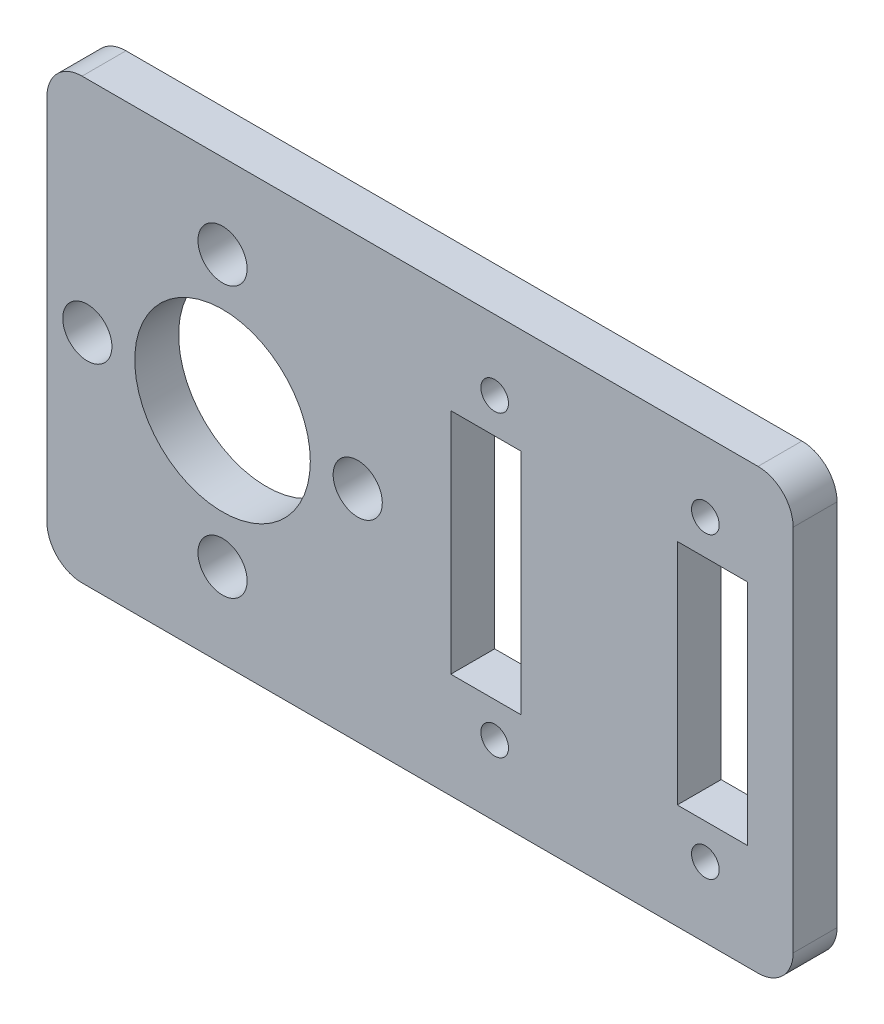
ISO-10303-21;
HEADER;
FILE_DESCRIPTION(('STEP AP214'),'2;1');
FILE_NAME('part.step','',(''),(''),'','','');
FILE_SCHEMA(('AUTOMOTIVE_DESIGN { 1 0 10303 214 1 1 1 1 }'));
ENDSEC;
DATA;
#1=APPLICATION_CONTEXT('core data for automotive mechanical design processes');
#2=APPLICATION_PROTOCOL_DEFINITION('international standard','automotive_design',2000,#1);
#3=PRODUCT_CONTEXT('',#1,'mechanical');
#4=PRODUCT('Part','Part','',(#3));
#5=PRODUCT_RELATED_PRODUCT_CATEGORY('part','',(#4));
#6=PRODUCT_DEFINITION_FORMATION('','',#4);
#7=PRODUCT_DEFINITION_CONTEXT('part definition',#1,'design');
#8=PRODUCT_DEFINITION('design','',#6,#7);
#9=PRODUCT_DEFINITION_SHAPE('','',#8);
#10=(LENGTH_UNIT() NAMED_UNIT(*) SI_UNIT(.MILLI.,.METRE.));
#11=(NAMED_UNIT(*) PLANE_ANGLE_UNIT() SI_UNIT($,.RADIAN.));
#12=(NAMED_UNIT(*) SI_UNIT($,.STERADIAN.) SOLID_ANGLE_UNIT());
#13=UNCERTAINTY_MEASURE_WITH_UNIT(LENGTH_MEASURE(1.E-05),#10,'distance_accuracy_value','');
#14=(GEOMETRIC_REPRESENTATION_CONTEXT(3) GLOBAL_UNCERTAINTY_ASSIGNED_CONTEXT((#13)) GLOBAL_UNIT_ASSIGNED_CONTEXT((#10,
#11,#12)) REPRESENTATION_CONTEXT('',''));
#15=CARTESIAN_POINT('',(0.,0.,0.));
#16=DIRECTION('',(0.,0.,1.));
#17=DIRECTION('',(1.,0.,0.));
#18=AXIS2_PLACEMENT_3D('',#15,#16,#17);
#19=CARTESIAN_POINT('',(0.,0.,3.175));
#20=DIRECTION('',(0.,0.,-1.));
#21=DIRECTION('',(-1.,0.,0.));
#22=AXIS2_PLACEMENT_3D('',#19,#20,#21);
#23=PLANE('',#22);
#24=CARTESIAN_POINT('',(2.921,15.875,3.175));
#25=DIRECTION('',(0.,0.,1.));
#26=DIRECTION('',(0.,1.,0.));
#27=AXIS2_PLACEMENT_3D('',#24,#25,#26);
#28=CIRCLE('',#27,1.778);
#29=CARTESIAN_POINT('',(2.92099999999999,17.653,3.175));
#30=VERTEX_POINT('',#29);
#31=EDGE_CURVE('E638',#30,#30,#28,.T.);
#32=ORIENTED_EDGE('',*,*,#31,.F.);
#33=EDGE_LOOP('',(#32));
#34=FACE_BOUND('',#33,.T.);
#35=CARTESIAN_POINT('',(12.7,6.096,3.175));
#36=DIRECTION('',(0.,0.,1.));
#37=DIRECTION('',(-1.,0.,0.));
#38=AXIS2_PLACEMENT_3D('',#35,#36,#37);
#39=CIRCLE('',#38,1.778);
#40=CARTESIAN_POINT('',(10.922,6.096,3.175));
#41=VERTEX_POINT('',#40);
#42=EDGE_CURVE('E632',#41,#41,#39,.T.);
#43=ORIENTED_EDGE('',*,*,#42,.F.);
#44=EDGE_LOOP('',(#43));
#45=FACE_BOUND('',#44,.T.);
#46=CARTESIAN_POINT('',(22.479,15.8750000000001,3.175));
#47=DIRECTION('',(0.,0.,1.));
#48=DIRECTION('',(0.,-1.,0.));
#49=AXIS2_PLACEMENT_3D('',#46,#47,#48);
#50=CIRCLE('',#49,1.778);
#51=CARTESIAN_POINT('',(22.479,14.0970000000001,3.175));
#52=VERTEX_POINT('',#51);
#53=EDGE_CURVE('E626',#52,#52,#50,.T.);
#54=ORIENTED_EDGE('',*,*,#53,.F.);
#55=EDGE_LOOP('',(#54));
#56=FACE_BOUND('',#55,.T.);
#57=CARTESIAN_POINT('',(12.7,25.654,3.175));
#58=DIRECTION('',(0.,0.,1.));
#59=DIRECTION('',(1.,0.,0.));
#60=AXIS2_PLACEMENT_3D('',#57,#58,#59);
#61=CIRCLE('',#60,1.778);
#62=CARTESIAN_POINT('',(14.478,25.654,3.175));
#63=VERTEX_POINT('',#62);
#64=EDGE_CURVE('E620',#63,#63,#61,.T.);
#65=ORIENTED_EDGE('',*,*,#64,.F.);
#66=EDGE_LOOP('',(#65));
#67=FACE_BOUND('',#66,.T.);
#68=CARTESIAN_POINT('',(12.7,15.875,3.175));
#69=DIRECTION('',(0.,0.,1.));
#70=DIRECTION('',(1.,0.,0.));
#71=AXIS2_PLACEMENT_3D('',#68,#69,#70);
#72=CIRCLE('',#71,6.35);
#73=CARTESIAN_POINT('',(19.05,15.875,3.175));
#74=VERTEX_POINT('',#73);
#75=EDGE_CURVE('E615',#74,#74,#72,.T.);
#76=ORIENTED_EDGE('',*,*,#75,.F.);
#77=EDGE_LOOP('',(#76));
#78=FACE_BOUND('',#77,.T.);
#79=DIRECTION('',(0.,-1.,0.));
#80=VECTOR('',#79,1.);
#81=CARTESIAN_POINT('',(29.21,24.13,3.175));
#82=LINE('',#81,#80);
#83=CARTESIAN_POINT('',(29.21,24.13,3.175));
#84=VERTEX_POINT('',#83);
#85=CARTESIAN_POINT('',(29.21,7.62,3.175));
#86=VERTEX_POINT('',#85);
#87=EDGE_CURVE('E191',#84,#86,#82,.T.);
#88=ORIENTED_EDGE('',*,*,#87,.F.);
#89=DIRECTION('',(-1.,0.,0.));
#90=VECTOR('',#89,1.);
#91=CARTESIAN_POINT('',(29.21,24.13,3.175));
#92=LINE('',#91,#90);
#93=CARTESIAN_POINT('',(34.29,24.13,3.175));
#94=VERTEX_POINT('',#93);
#95=EDGE_CURVE('E199',#94,#84,#92,.T.);
#96=ORIENTED_EDGE('',*,*,#95,.F.);
#97=DIRECTION('',(0.,1.,0.));
#98=VECTOR('',#97,1.);
#99=CARTESIAN_POINT('',(34.29,24.13,3.175));
#100=LINE('',#99,#98);
#101=CARTESIAN_POINT('',(34.29,7.62,3.175));
#102=VERTEX_POINT('',#101);
#103=EDGE_CURVE('E196',#102,#94,#100,.T.);
#104=ORIENTED_EDGE('',*,*,#103,.F.);
#105=DIRECTION('',(1.,0.,0.));
#106=VECTOR('',#105,1.);
#107=CARTESIAN_POINT('',(29.21,7.62,3.175));
#108=LINE('',#107,#106);
#109=EDGE_CURVE('E193',#86,#102,#108,.T.);
#110=ORIENTED_EDGE('',*,*,#109,.F.);
#111=EDGE_LOOP('',(#88,#96,#104,#110));
#112=FACE_BOUND('',#111,.T.);
#113=DIRECTION('',(-1.,0.,0.));
#114=VECTOR('',#113,1.);
#115=CARTESIAN_POINT('',(0.,31.75,3.175));
#116=LINE('',#115,#114);
#117=CARTESIAN_POINT('',(51.435,31.75,3.175));
#118=VERTEX_POINT('',#117);
#119=CARTESIAN_POINT('',(2.54,31.75,3.175));
#120=VERTEX_POINT('',#119);
#121=EDGE_CURVE('E254',#118,#120,#116,.T.);
#122=ORIENTED_EDGE('',*,*,#121,.T.);
#123=CARTESIAN_POINT('',(2.54,29.21,3.175));
#124=DIRECTION('',(0.,0.,-1.));
#125=DIRECTION('',(-1.,0.,0.));
#126=AXIS2_PLACEMENT_3D('',#123,#124,#125);
#127=CIRCLE('',#126,2.54);
#128=CARTESIAN_POINT('',(0.,29.21,3.175));
#129=VERTEX_POINT('',#128);
#130=EDGE_CURVE('E289',#120,#129,#127,.F.);
#131=ORIENTED_EDGE('',*,*,#130,.T.);
#132=DIRECTION('',(0.,-1.,0.));
#133=VECTOR('',#132,1.);
#134=CARTESIAN_POINT('',(0.,0.,3.175));
#135=LINE('',#134,#133);
#136=CARTESIAN_POINT('',(0.,2.54,3.175));
#137=VERTEX_POINT('',#136);
#138=EDGE_CURVE('E246',#129,#137,#135,.T.);
#139=ORIENTED_EDGE('',*,*,#138,.T.);
#140=CARTESIAN_POINT('',(2.54,2.54,3.175));
#141=DIRECTION('',(0.,0.,-1.));
#142=DIRECTION('',(-1.,0.,0.));
#143=AXIS2_PLACEMENT_3D('',#140,#141,#142);
#144=CIRCLE('',#143,2.54);
#145=CARTESIAN_POINT('',(2.54,0.,3.175));
#146=VERTEX_POINT('',#145);
#147=EDGE_CURVE('E284',#137,#146,#144,.F.);
#148=ORIENTED_EDGE('',*,*,#147,.T.);
#149=DIRECTION('',(1.,0.,0.));
#150=VECTOR('',#149,1.);
#151=CARTESIAN_POINT('',(0.,0.,3.175));
#152=LINE('',#151,#150);
#153=CARTESIAN_POINT('',(51.435,0.,3.175));
#154=VERTEX_POINT('',#153);
#155=EDGE_CURVE('E249',#146,#154,#152,.T.);
#156=ORIENTED_EDGE('',*,*,#155,.T.);
#157=CARTESIAN_POINT('',(51.435,2.54,3.175));
#158=DIRECTION('',(0.,0.,-1.));
#159=DIRECTION('',(-1.,0.,0.));
#160=AXIS2_PLACEMENT_3D('',#157,#158,#159);
#161=CIRCLE('',#160,2.54);
#162=CARTESIAN_POINT('',(53.975,2.54,3.175));
#163=VERTEX_POINT('',#162);
#164=EDGE_CURVE('E55',#154,#163,#161,.F.);
#165=ORIENTED_EDGE('',*,*,#164,.T.);
#166=DIRECTION('',(0.,1.,0.));
#167=VECTOR('',#166,1.);
#168=CARTESIAN_POINT('',(53.975,0.,3.175));
#169=LINE('',#168,#167);
#170=CARTESIAN_POINT('',(53.975,29.21,3.175));
#171=VERTEX_POINT('',#170);
#172=EDGE_CURVE('E252',#163,#171,#169,.T.);
#173=ORIENTED_EDGE('',*,*,#172,.T.);
#174=CARTESIAN_POINT('',(51.435,29.21,3.175));
#175=DIRECTION('',(0.,0.,-1.));
#176=DIRECTION('',(-1.,0.,0.));
#177=AXIS2_PLACEMENT_3D('',#174,#175,#176);
#178=CIRCLE('',#177,2.54);
#179=EDGE_CURVE('E287',#171,#118,#178,.F.);
#180=ORIENTED_EDGE('',*,*,#179,.T.);
#181=EDGE_LOOP('',(#122,#131,#139,#148,#156,#165,#173,#180));
#182=FACE_BOUND('',#181,.T.);
#183=CARTESIAN_POINT('',(32.385,26.67,3.175));
#184=DIRECTION('',(0.,0.,1.));
#185=DIRECTION('',(1.,0.,0.));
#186=AXIS2_PLACEMENT_3D('',#183,#184,#185);
#187=CIRCLE('',#186,0.999999999999998);
#188=CARTESIAN_POINT('',(33.385,26.67,3.175));
#189=VERTEX_POINT('',#188);
#190=EDGE_CURVE('E240',#189,#189,#187,.T.);
#191=ORIENTED_EDGE('',*,*,#190,.F.);
#192=EDGE_LOOP('',(#191));
#193=FACE_BOUND('',#192,.T.);
#194=CARTESIAN_POINT('',(47.625,26.67,3.175));
#195=DIRECTION('',(0.,0.,1.));
#196=DIRECTION('',(1.,0.,0.));
#197=AXIS2_PLACEMENT_3D('',#194,#195,#196);
#198=CIRCLE('',#197,0.999999999999998);
#199=CARTESIAN_POINT('',(48.625,26.67,3.175));
#200=VERTEX_POINT('',#199);
#201=EDGE_CURVE('E234',#200,#200,#198,.T.);
#202=ORIENTED_EDGE('',*,*,#201,.F.);
#203=EDGE_LOOP('',(#202));
#204=FACE_BOUND('',#203,.T.);
#205=CARTESIAN_POINT('',(32.385,5.08,3.175));
#206=DIRECTION('',(0.,0.,1.));
#207=DIRECTION('',(1.,0.,0.));
#208=AXIS2_PLACEMENT_3D('',#205,#206,#207);
#209=CIRCLE('',#208,0.999999999999998);
#210=CARTESIAN_POINT('',(33.385,5.08,3.175));
#211=VERTEX_POINT('',#210);
#212=EDGE_CURVE('E228',#211,#211,#209,.T.);
#213=ORIENTED_EDGE('',*,*,#212,.F.);
#214=EDGE_LOOP('',(#213));
#215=FACE_BOUND('',#214,.T.);
#216=CARTESIAN_POINT('',(47.625,5.08,3.175));
#217=DIRECTION('',(0.,0.,1.));
#218=DIRECTION('',(1.,0.,0.));
#219=AXIS2_PLACEMENT_3D('',#216,#217,#218);
#220=CIRCLE('',#219,0.999999999999998);
#221=CARTESIAN_POINT('',(48.625,5.08,3.175));
#222=VERTEX_POINT('',#221);
#223=EDGE_CURVE('E222',#222,#222,#220,.T.);
#224=ORIENTED_EDGE('',*,*,#223,.F.);
#225=EDGE_LOOP('',(#224));
#226=FACE_BOUND('',#225,.T.);
#227=DIRECTION('',(0.,-1.,0.));
#228=VECTOR('',#227,1.);
#229=CARTESIAN_POINT('',(45.593,24.13,3.175));
#230=LINE('',#229,#228);
#231=CARTESIAN_POINT('',(45.593,24.13,3.175));
#232=VERTEX_POINT('',#231);
#233=CARTESIAN_POINT('',(45.593,7.62,3.175));
#234=VERTEX_POINT('',#233);
#235=EDGE_CURVE('E148',#232,#234,#230,.T.);
#236=ORIENTED_EDGE('',*,*,#235,.F.);
#237=DIRECTION('',(-1.,0.,0.));
#238=VECTOR('',#237,1.);
#239=CARTESIAN_POINT('',(45.593,24.13,3.175));
#240=LINE('',#239,#238);
#241=CARTESIAN_POINT('',(50.673,24.13,3.175));
#242=VERTEX_POINT('',#241);
#243=EDGE_CURVE('E173',#242,#232,#240,.T.);
#244=ORIENTED_EDGE('',*,*,#243,.F.);
#245=DIRECTION('',(0.,1.,0.));
#246=VECTOR('',#245,1.);
#247=CARTESIAN_POINT('',(50.673,24.13,3.175));
#248=LINE('',#247,#246);
#249=CARTESIAN_POINT('',(50.673,7.62,3.175));
#250=VERTEX_POINT('',#249);
#251=EDGE_CURVE('E171',#250,#242,#248,.T.);
#252=ORIENTED_EDGE('',*,*,#251,.F.);
#253=DIRECTION('',(1.,0.,0.));
#254=VECTOR('',#253,1.);
#255=CARTESIAN_POINT('',(45.593,7.62,3.175));
#256=LINE('',#255,#254);
#257=EDGE_CURVE('E158',#234,#250,#256,.T.);
#258=ORIENTED_EDGE('',*,*,#257,.F.);
#259=EDGE_LOOP('',(#236,#244,#252,#258));
#260=FACE_BOUND('',#259,.T.);
#261=ADVANCED_FACE('F33',(#34,#45,#56,#67,#78,#112,#182,#193,#204,#215,#226,#260),#23,.F.);
#262=CARTESIAN_POINT('',(0.,0.,0.));
#263=DIRECTION('',(0.,0.,-1.));
#264=DIRECTION('',(-1.,0.,0.));
#265=AXIS2_PLACEMENT_3D('',#262,#263,#264);
#266=PLANE('',#265);
#267=CARTESIAN_POINT('',(2.921,15.875,0.));
#268=DIRECTION('',(0.,0.,1.));
#269=DIRECTION('',(0.,1.,0.));
#270=AXIS2_PLACEMENT_3D('',#267,#268,#269);
#271=CIRCLE('',#270,1.778);
#272=CARTESIAN_POINT('',(2.92099999999999,17.653,0.));
#273=VERTEX_POINT('',#272);
#274=EDGE_CURVE('E624',#273,#273,#271,.T.);
#275=ORIENTED_EDGE('',*,*,#274,.T.);
#276=EDGE_LOOP('',(#275));
#277=FACE_BOUND('',#276,.T.);
#278=CARTESIAN_POINT('',(12.7,6.096,0.));
#279=DIRECTION('',(0.,0.,1.));
#280=DIRECTION('',(-1.,0.,0.));
#281=AXIS2_PLACEMENT_3D('',#278,#279,#280);
#282=CIRCLE('',#281,1.778);
#283=CARTESIAN_POINT('',(10.922,6.096,0.));
#284=VERTEX_POINT('',#283);
#285=EDGE_CURVE('E635',#284,#284,#282,.T.);
#286=ORIENTED_EDGE('',*,*,#285,.T.);
#287=EDGE_LOOP('',(#286));
#288=FACE_BOUND('',#287,.T.);
#289=CARTESIAN_POINT('',(22.479,15.8750000000001,0.));
#290=DIRECTION('',(0.,0.,1.));
#291=DIRECTION('',(0.,-1.,0.));
#292=AXIS2_PLACEMENT_3D('',#289,#290,#291);
#293=CIRCLE('',#292,1.778);
#294=CARTESIAN_POINT('',(22.479,14.0970000000001,0.));
#295=VERTEX_POINT('',#294);
#296=EDGE_CURVE('E629',#295,#295,#293,.T.);
#297=ORIENTED_EDGE('',*,*,#296,.T.);
#298=EDGE_LOOP('',(#297));
#299=FACE_BOUND('',#298,.T.);
#300=CARTESIAN_POINT('',(12.7,25.654,0.));
#301=DIRECTION('',(0.,0.,1.));
#302=DIRECTION('',(1.,0.,0.));
#303=AXIS2_PLACEMENT_3D('',#300,#301,#302);
#304=CIRCLE('',#303,1.778);
#305=CARTESIAN_POINT('',(14.478,25.654,0.));
#306=VERTEX_POINT('',#305);
#307=EDGE_CURVE('E617',#306,#306,#304,.T.);
#308=ORIENTED_EDGE('',*,*,#307,.T.);
#309=EDGE_LOOP('',(#308));
#310=FACE_BOUND('',#309,.T.);
#311=CARTESIAN_POINT('',(12.7,15.875,0.));
#312=DIRECTION('',(0.,0.,1.));
#313=DIRECTION('',(1.,0.,0.));
#314=AXIS2_PLACEMENT_3D('',#311,#312,#313);
#315=CIRCLE('',#314,6.35);
#316=CARTESIAN_POINT('',(19.05,15.875,0.));
#317=VERTEX_POINT('',#316);
#318=EDGE_CURVE('E180',#317,#317,#315,.T.);
#319=ORIENTED_EDGE('',*,*,#318,.T.);
#320=EDGE_LOOP('',(#319));
#321=FACE_BOUND('',#320,.T.);
#322=CARTESIAN_POINT('',(32.385,5.08,0.));
#323=DIRECTION('',(0.,0.,1.));
#324=DIRECTION('',(1.,0.,0.));
#325=AXIS2_PLACEMENT_3D('',#322,#323,#324);
#326=CIRCLE('',#325,0.999999999999998);
#327=CARTESIAN_POINT('',(33.385,5.08,0.));
#328=VERTEX_POINT('',#327);
#329=EDGE_CURVE('E225',#328,#328,#326,.T.);
#330=ORIENTED_EDGE('',*,*,#329,.T.);
#331=EDGE_LOOP('',(#330));
#332=FACE_BOUND('',#331,.T.);
#333=CARTESIAN_POINT('',(32.385,26.67,0.));
#334=DIRECTION('',(0.,0.,1.));
#335=DIRECTION('',(1.,0.,0.));
#336=AXIS2_PLACEMENT_3D('',#333,#334,#335);
#337=CIRCLE('',#336,0.999999999999998);
#338=CARTESIAN_POINT('',(33.385,26.67,0.));
#339=VERTEX_POINT('',#338);
#340=EDGE_CURVE('E237',#339,#339,#337,.T.);
#341=ORIENTED_EDGE('',*,*,#340,.T.);
#342=EDGE_LOOP('',(#341));
#343=FACE_BOUND('',#342,.T.);
#344=DIRECTION('',(0.,-1.,0.));
#345=VECTOR('',#344,1.);
#346=CARTESIAN_POINT('',(0.,0.,0.));
#347=LINE('',#346,#345);
#348=CARTESIAN_POINT('',(0.,29.21,0.));
#349=VERTEX_POINT('',#348);
#350=CARTESIAN_POINT('',(0.,2.54,0.));
#351=VERTEX_POINT('',#350);
#352=EDGE_CURVE('E243',#349,#351,#347,.T.);
#353=ORIENTED_EDGE('',*,*,#352,.F.);
#354=CARTESIAN_POINT('',(2.54,29.21,0.));
#355=DIRECTION('',(0.,0.,-1.));
#356=DIRECTION('',(-1.,0.,0.));
#357=AXIS2_PLACEMENT_3D('',#354,#355,#356);
#358=CIRCLE('',#357,2.54);
#359=CARTESIAN_POINT('',(2.54,31.75,0.));
#360=VERTEX_POINT('',#359);
#361=EDGE_CURVE('E277',#349,#360,#358,.T.);
#362=ORIENTED_EDGE('',*,*,#361,.T.);
#363=DIRECTION('',(-1.,0.,0.));
#364=VECTOR('',#363,1.);
#365=CARTESIAN_POINT('',(0.,31.75,0.));
#366=LINE('',#365,#364);
#367=CARTESIAN_POINT('',(51.435,31.75,0.));
#368=VERTEX_POINT('',#367);
#369=EDGE_CURVE('E250',#368,#360,#366,.T.);
#370=ORIENTED_EDGE('',*,*,#369,.F.);
#371=CARTESIAN_POINT('',(51.435,29.21,0.));
#372=DIRECTION('',(0.,0.,-1.));
#373=DIRECTION('',(-1.,0.,0.));
#374=AXIS2_PLACEMENT_3D('',#371,#372,#373);
#375=CIRCLE('',#374,2.54);
#376=CARTESIAN_POINT('',(53.975,29.21,0.));
#377=VERTEX_POINT('',#376);
#378=EDGE_CURVE('E275',#368,#377,#375,.T.);
#379=ORIENTED_EDGE('',*,*,#378,.T.);
#380=DIRECTION('',(0.,1.,0.));
#381=VECTOR('',#380,1.);
#382=CARTESIAN_POINT('',(53.975,0.,0.));
#383=LINE('',#382,#381);
#384=CARTESIAN_POINT('',(53.975,2.54,0.));
#385=VERTEX_POINT('',#384);
#386=EDGE_CURVE('E263',#385,#377,#383,.T.);
#387=ORIENTED_EDGE('',*,*,#386,.F.);
#388=CARTESIAN_POINT('',(51.435,2.54,0.));
#389=DIRECTION('',(0.,0.,-1.));
#390=DIRECTION('',(-1.,0.,0.));
#391=AXIS2_PLACEMENT_3D('',#388,#389,#390);
#392=CIRCLE('',#391,2.54);
#393=CARTESIAN_POINT('',(51.435,0.,0.));
#394=VERTEX_POINT('',#393);
#395=EDGE_CURVE('E273',#385,#394,#392,.T.);
#396=ORIENTED_EDGE('',*,*,#395,.T.);
#397=DIRECTION('',(1.,0.,0.));
#398=VECTOR('',#397,1.);
#399=CARTESIAN_POINT('',(0.,0.,0.));
#400=LINE('',#399,#398);
#401=CARTESIAN_POINT('',(2.54,0.,0.));
#402=VERTEX_POINT('',#401);
#403=EDGE_CURVE('E260',#402,#394,#400,.T.);
#404=ORIENTED_EDGE('',*,*,#403,.F.);
#405=CARTESIAN_POINT('',(2.54,2.54,0.));
#406=DIRECTION('',(0.,0.,-1.));
#407=DIRECTION('',(-1.,0.,0.));
#408=AXIS2_PLACEMENT_3D('',#405,#406,#407);
#409=CIRCLE('',#408,2.54);
#410=EDGE_CURVE('E271',#402,#351,#409,.T.);
#411=ORIENTED_EDGE('',*,*,#410,.T.);
#412=EDGE_LOOP('',(#353,#362,#370,#379,#387,#396,#404,#411));
#413=FACE_BOUND('',#412,.T.);
#414=CARTESIAN_POINT('',(47.625,26.67,0.));
#415=DIRECTION('',(0.,0.,1.));
#416=DIRECTION('',(1.,0.,0.));
#417=AXIS2_PLACEMENT_3D('',#414,#415,#416);
#418=CIRCLE('',#417,0.999999999999998);
#419=CARTESIAN_POINT('',(48.625,26.67,0.));
#420=VERTEX_POINT('',#419);
#421=EDGE_CURVE('E231',#420,#420,#418,.T.);
#422=ORIENTED_EDGE('',*,*,#421,.T.);
#423=EDGE_LOOP('',(#422));
#424=FACE_BOUND('',#423,.T.);
#425=CARTESIAN_POINT('',(47.625,5.08,0.));
#426=DIRECTION('',(0.,0.,1.));
#427=DIRECTION('',(1.,0.,0.));
#428=AXIS2_PLACEMENT_3D('',#425,#426,#427);
#429=CIRCLE('',#428,0.999999999999998);
#430=CARTESIAN_POINT('',(48.625,5.08,0.));
#431=VERTEX_POINT('',#430);
#432=EDGE_CURVE('E221',#431,#431,#429,.T.);
#433=ORIENTED_EDGE('',*,*,#432,.T.);
#434=EDGE_LOOP('',(#433));
#435=FACE_BOUND('',#434,.T.);
#436=DIRECTION('',(-1.,0.,0.));
#437=VECTOR('',#436,1.);
#438=CARTESIAN_POINT('',(29.21,24.13,0.));
#439=LINE('',#438,#437);
#440=CARTESIAN_POINT('',(34.29,24.13,0.));
#441=VERTEX_POINT('',#440);
#442=CARTESIAN_POINT('',(29.21,24.13,0.));
#443=VERTEX_POINT('',#442);
#444=EDGE_CURVE('E194',#441,#443,#439,.T.);
#445=ORIENTED_EDGE('',*,*,#444,.T.);
#446=DIRECTION('',(0.,-1.,0.));
#447=VECTOR('',#446,1.);
#448=CARTESIAN_POINT('',(29.21,24.13,0.));
#449=LINE('',#448,#447);
#450=CARTESIAN_POINT('',(29.21,7.62,0.));
#451=VERTEX_POINT('',#450);
#452=EDGE_CURVE('E166',#443,#451,#449,.T.);
#453=ORIENTED_EDGE('',*,*,#452,.T.);
#454=DIRECTION('',(1.,0.,0.));
#455=VECTOR('',#454,1.);
#456=CARTESIAN_POINT('',(29.21,7.62,0.));
#457=LINE('',#456,#455);
#458=CARTESIAN_POINT('',(34.29,7.62,0.));
#459=VERTEX_POINT('',#458);
#460=EDGE_CURVE('E204',#451,#459,#457,.T.);
#461=ORIENTED_EDGE('',*,*,#460,.T.);
#462=DIRECTION('',(0.,1.,0.));
#463=VECTOR('',#462,1.);
#464=CARTESIAN_POINT('',(34.29,24.13,0.));
#465=LINE('',#464,#463);
#466=EDGE_CURVE('E207',#459,#441,#465,.T.);
#467=ORIENTED_EDGE('',*,*,#466,.T.);
#468=EDGE_LOOP('',(#445,#453,#461,#467));
#469=FACE_BOUND('',#468,.T.);
#470=DIRECTION('',(-1.,0.,0.));
#471=VECTOR('',#470,1.);
#472=CARTESIAN_POINT('',(45.593,24.13,0.));
#473=LINE('',#472,#471);
#474=CARTESIAN_POINT('',(50.673,24.13,0.));
#475=VERTEX_POINT('',#474);
#476=CARTESIAN_POINT('',(45.593,24.13,0.));
#477=VERTEX_POINT('',#476);
#478=EDGE_CURVE('E159',#475,#477,#473,.T.);
#479=ORIENTED_EDGE('',*,*,#478,.T.);
#480=DIRECTION('',(0.,-1.,0.));
#481=VECTOR('',#480,1.);
#482=CARTESIAN_POINT('',(45.593,24.13,0.));
#483=LINE('',#482,#481);
#484=CARTESIAN_POINT('',(45.593,7.62,0.));
#485=VERTEX_POINT('',#484);
#486=EDGE_CURVE('E178',#477,#485,#483,.T.);
#487=ORIENTED_EDGE('',*,*,#486,.T.);
#488=DIRECTION('',(1.,0.,0.));
#489=VECTOR('',#488,1.);
#490=CARTESIAN_POINT('',(45.593,7.62,0.));
#491=LINE('',#490,#489);
#492=CARTESIAN_POINT('',(50.673,7.62,0.));
#493=VERTEX_POINT('',#492);
#494=EDGE_CURVE('E165',#485,#493,#491,.T.);
#495=ORIENTED_EDGE('',*,*,#494,.T.);
#496=DIRECTION('',(0.,1.,0.));
#497=VECTOR('',#496,1.);
#498=CARTESIAN_POINT('',(50.673,24.13,0.));
#499=LINE('',#498,#497);
#500=EDGE_CURVE('E182',#493,#475,#499,.T.);
#501=ORIENTED_EDGE('',*,*,#500,.T.);
#502=EDGE_LOOP('',(#479,#487,#495,#501));
#503=FACE_BOUND('',#502,.T.);
#504=ADVANCED_FACE('F305',(#277,#288,#299,#310,#321,#332,#343,#413,#424,#435,#469,#503),#266,.T.);
#505=CARTESIAN_POINT('',(0.,0.,3.175));
#506=DIRECTION('',(1.,0.,0.));
#507=DIRECTION('',(0.,0.,-1.));
#508=AXIS2_PLACEMENT_3D('',#505,#506,#507);
#509=PLANE('',#508);
#510=ORIENTED_EDGE('',*,*,#138,.F.);
#511=DIRECTION('',(0.,0.,-1.));
#512=VECTOR('',#511,1.);
#513=CARTESIAN_POINT('',(0.,29.21,3.175));
#514=LINE('',#513,#512);
#515=EDGE_CURVE('E268',#129,#349,#514,.T.);
#516=ORIENTED_EDGE('',*,*,#515,.T.);
#517=ORIENTED_EDGE('',*,*,#352,.T.);
#518=DIRECTION('',(0.,0.,-1.));
#519=VECTOR('',#518,1.);
#520=CARTESIAN_POINT('',(0.,2.54,3.175));
#521=LINE('',#520,#519);
#522=EDGE_CURVE('E257',#351,#137,#521,.F.);
#523=ORIENTED_EDGE('',*,*,#522,.T.);
#524=EDGE_LOOP('',(#510,#516,#517,#523));
#525=FACE_BOUND('',#524,.T.);
#526=ADVANCED_FACE('F328',(#525),#509,.F.);
#527=CARTESIAN_POINT('',(0.,0.,3.175));
#528=DIRECTION('',(0.,1.,0.));
#529=DIRECTION('',(0.,0.,1.));
#530=AXIS2_PLACEMENT_3D('',#527,#528,#529);
#531=PLANE('',#530);
#532=ORIENTED_EDGE('',*,*,#403,.T.);
#533=DIRECTION('',(0.,0.,-1.));
#534=VECTOR('',#533,1.);
#535=CARTESIAN_POINT('',(51.435,0.,3.175));
#536=LINE('',#535,#534);
#537=EDGE_CURVE('E11',#394,#154,#536,.F.);
#538=ORIENTED_EDGE('',*,*,#537,.T.);
#539=ORIENTED_EDGE('',*,*,#155,.F.);
#540=DIRECTION('',(0.,0.,-1.));
#541=VECTOR('',#540,1.);
#542=CARTESIAN_POINT('',(2.54,0.,3.175));
#543=LINE('',#542,#541);
#544=EDGE_CURVE('E41',#146,#402,#543,.T.);
#545=ORIENTED_EDGE('',*,*,#544,.T.);
#546=EDGE_LOOP('',(#532,#538,#539,#545));
#547=FACE_BOUND('',#546,.T.);
#548=ADVANCED_FACE('F299',(#547),#531,.F.);
#549=CARTESIAN_POINT('',(53.975,0.,3.175));
#550=DIRECTION('',(-1.,0.,0.));
#551=DIRECTION('',(0.,0.,1.));
#552=AXIS2_PLACEMENT_3D('',#549,#550,#551);
#553=PLANE('',#552);
#554=ORIENTED_EDGE('',*,*,#386,.T.);
#555=DIRECTION('',(0.,0.,-1.));
#556=VECTOR('',#555,1.);
#557=CARTESIAN_POINT('',(53.975,29.21,3.175));
#558=LINE('',#557,#556);
#559=EDGE_CURVE('E48',#377,#171,#558,.F.);
#560=ORIENTED_EDGE('',*,*,#559,.T.);
#561=ORIENTED_EDGE('',*,*,#172,.F.);
#562=DIRECTION('',(0.,0.,-1.));
#563=VECTOR('',#562,1.);
#564=CARTESIAN_POINT('',(53.975,2.54,3.175));
#565=LINE('',#564,#563);
#566=EDGE_CURVE('E291',#163,#385,#565,.T.);
#567=ORIENTED_EDGE('',*,*,#566,.T.);
#568=EDGE_LOOP('',(#554,#560,#561,#567));
#569=FACE_BOUND('',#568,.T.);
#570=ADVANCED_FACE('F311',(#569),#553,.F.);
#571=CARTESIAN_POINT('',(0.,31.75,3.175));
#572=DIRECTION('',(0.,-1.,0.));
#573=DIRECTION('',(0.,0.,-1.));
#574=AXIS2_PLACEMENT_3D('',#571,#572,#573);
#575=PLANE('',#574);
#576=ORIENTED_EDGE('',*,*,#369,.T.);
#577=DIRECTION('',(0.,0.,-1.));
#578=VECTOR('',#577,1.);
#579=CARTESIAN_POINT('',(2.54,31.75,3.175));
#580=LINE('',#579,#578);
#581=EDGE_CURVE('E282',#360,#120,#580,.F.);
#582=ORIENTED_EDGE('',*,*,#581,.T.);
#583=ORIENTED_EDGE('',*,*,#121,.F.);
#584=DIRECTION('',(0.,0.,-1.));
#585=VECTOR('',#584,1.);
#586=CARTESIAN_POINT('',(51.435,31.75,3.175));
#587=LINE('',#586,#585);
#588=EDGE_CURVE('E279',#118,#368,#587,.T.);
#589=ORIENTED_EDGE('',*,*,#588,.T.);
#590=EDGE_LOOP('',(#576,#582,#583,#589));
#591=FACE_BOUND('',#590,.T.);
#592=ADVANCED_FACE('F320',(#591),#575,.F.);
#593=CARTESIAN_POINT('',(32.385,26.67,3.175));
#594=DIRECTION('',(0.,0.,-1.));
#595=DIRECTION('',(-1.,0.,0.));
#596=AXIS2_PLACEMENT_3D('',#593,#594,#595);
#597=CYLINDRICAL_SURFACE('',#596,0.999999999999998);
#598=ORIENTED_EDGE('',*,*,#190,.T.);
#599=EDGE_LOOP('',(#598));
#600=FACE_BOUND('',#599,.T.);
#601=ORIENTED_EDGE('',*,*,#340,.F.);
#602=EDGE_LOOP('',(#601));
#603=FACE_BOUND('',#602,.T.);
#604=ADVANCED_FACE('F346',(#600,#603),#597,.F.);
#605=CARTESIAN_POINT('',(47.625,26.67,3.175));
#606=DIRECTION('',(0.,0.,-1.));
#607=DIRECTION('',(-1.,0.,0.));
#608=AXIS2_PLACEMENT_3D('',#605,#606,#607);
#609=CYLINDRICAL_SURFACE('',#608,0.999999999999998);
#610=ORIENTED_EDGE('',*,*,#201,.T.);
#611=EDGE_LOOP('',(#610));
#612=FACE_BOUND('',#611,.T.);
#613=ORIENTED_EDGE('',*,*,#421,.F.);
#614=EDGE_LOOP('',(#613));
#615=FACE_BOUND('',#614,.T.);
#616=ADVANCED_FACE('F510',(#612,#615),#609,.F.);
#617=CARTESIAN_POINT('',(32.385,5.08,3.175));
#618=DIRECTION('',(0.,0.,-1.));
#619=DIRECTION('',(-1.,0.,0.));
#620=AXIS2_PLACEMENT_3D('',#617,#618,#619);
#621=CYLINDRICAL_SURFACE('',#620,0.999999999999998);
#622=ORIENTED_EDGE('',*,*,#212,.T.);
#623=EDGE_LOOP('',(#622));
#624=FACE_BOUND('',#623,.T.);
#625=ORIENTED_EDGE('',*,*,#329,.F.);
#626=EDGE_LOOP('',(#625));
#627=FACE_BOUND('',#626,.T.);
#628=ADVANCED_FACE('F501',(#624,#627),#621,.F.);
#629=CARTESIAN_POINT('',(47.625,5.08,3.175));
#630=DIRECTION('',(0.,0.,-1.));
#631=DIRECTION('',(-1.,0.,0.));
#632=AXIS2_PLACEMENT_3D('',#629,#630,#631);
#633=CYLINDRICAL_SURFACE('',#632,0.999999999999998);
#634=ORIENTED_EDGE('',*,*,#223,.T.);
#635=EDGE_LOOP('',(#634));
#636=FACE_BOUND('',#635,.T.);
#637=ORIENTED_EDGE('',*,*,#432,.F.);
#638=EDGE_LOOP('',(#637));
#639=FACE_BOUND('',#638,.T.);
#640=ADVANCED_FACE('F492',(#636,#639),#633,.F.);
#641=CARTESIAN_POINT('',(29.21,24.13,3.175));
#642=DIRECTION('',(1.,0.,0.));
#643=DIRECTION('',(0.,1.,0.));
#644=AXIS2_PLACEMENT_3D('',#641,#642,#643);
#645=PLANE('',#644);
#646=ORIENTED_EDGE('',*,*,#452,.F.);
#647=DIRECTION('',(0.,0.,-1.));
#648=VECTOR('',#647,1.);
#649=CARTESIAN_POINT('',(29.21,24.13,3.175));
#650=LINE('',#649,#648);
#651=EDGE_CURVE('E201',#84,#443,#650,.T.);
#652=ORIENTED_EDGE('',*,*,#651,.F.);
#653=ORIENTED_EDGE('',*,*,#87,.T.);
#654=DIRECTION('',(0.,0.,-1.));
#655=VECTOR('',#654,1.);
#656=CARTESIAN_POINT('',(29.21,7.62,3.175));
#657=LINE('',#656,#655);
#658=EDGE_CURVE('E218',#86,#451,#657,.T.);
#659=ORIENTED_EDGE('',*,*,#658,.T.);
#660=EDGE_LOOP('',(#646,#652,#653,#659));
#661=FACE_BOUND('',#660,.T.);
#662=ADVANCED_FACE('F483',(#661),#645,.T.);
#663=CARTESIAN_POINT('',(29.21,7.62,3.175));
#664=DIRECTION('',(0.,1.,0.));
#665=DIRECTION('',(-1.,0.,0.));
#666=AXIS2_PLACEMENT_3D('',#663,#664,#665);
#667=PLANE('',#666);
#668=ORIENTED_EDGE('',*,*,#460,.F.);
#669=ORIENTED_EDGE('',*,*,#658,.F.);
#670=ORIENTED_EDGE('',*,*,#109,.T.);
#671=DIRECTION('',(0.,0.,-1.));
#672=VECTOR('',#671,1.);
#673=CARTESIAN_POINT('',(34.29,7.62,3.175));
#674=LINE('',#673,#672);
#675=EDGE_CURVE('E216',#102,#459,#674,.T.);
#676=ORIENTED_EDGE('',*,*,#675,.T.);
#677=EDGE_LOOP('',(#668,#669,#670,#676));
#678=FACE_BOUND('',#677,.T.);
#679=ADVANCED_FACE('F474',(#678),#667,.T.);
#680=CARTESIAN_POINT('',(34.29,24.13,3.175));
#681=DIRECTION('',(-1.,0.,0.));
#682=DIRECTION('',(0.,0.,1.));
#683=AXIS2_PLACEMENT_3D('',#680,#681,#682);
#684=PLANE('',#683);
#685=ORIENTED_EDGE('',*,*,#466,.F.);
#686=ORIENTED_EDGE('',*,*,#675,.F.);
#687=ORIENTED_EDGE('',*,*,#103,.T.);
#688=DIRECTION('',(0.,0.,-1.));
#689=VECTOR('',#688,1.);
#690=CARTESIAN_POINT('',(34.29,24.13,3.175));
#691=LINE('',#690,#689);
#692=EDGE_CURVE('E214',#94,#441,#691,.T.);
#693=ORIENTED_EDGE('',*,*,#692,.T.);
#694=EDGE_LOOP('',(#685,#686,#687,#693));
#695=FACE_BOUND('',#694,.T.);
#696=ADVANCED_FACE('F465',(#695),#684,.T.);
#697=CARTESIAN_POINT('',(29.21,24.13,3.175));
#698=DIRECTION('',(0.,-1.,0.));
#699=DIRECTION('',(0.,0.,-1.));
#700=AXIS2_PLACEMENT_3D('',#697,#698,#699);
#701=PLANE('',#700);
#702=ORIENTED_EDGE('',*,*,#444,.F.);
#703=ORIENTED_EDGE('',*,*,#692,.F.);
#704=ORIENTED_EDGE('',*,*,#95,.T.);
#705=ORIENTED_EDGE('',*,*,#651,.T.);
#706=EDGE_LOOP('',(#702,#703,#704,#705));
#707=FACE_BOUND('',#706,.T.);
#708=ADVANCED_FACE('F457',(#707),#701,.T.);
#709=CARTESIAN_POINT('',(45.593,24.13,3.175));
#710=DIRECTION('',(1.,0.,0.));
#711=DIRECTION('',(0.,0.,-1.));
#712=AXIS2_PLACEMENT_3D('',#709,#710,#711);
#713=PLANE('',#712);
#714=ORIENTED_EDGE('',*,*,#486,.F.);
#715=DIRECTION('',(0.,0.,-1.));
#716=VECTOR('',#715,1.);
#717=CARTESIAN_POINT('',(45.593,24.13,3.175));
#718=LINE('',#717,#716);
#719=EDGE_CURVE('E154',#232,#477,#718,.T.);
#720=ORIENTED_EDGE('',*,*,#719,.F.);
#721=ORIENTED_EDGE('',*,*,#235,.T.);
#722=DIRECTION('',(0.,0.,-1.));
#723=VECTOR('',#722,1.);
#724=CARTESIAN_POINT('',(45.593,7.62,3.175));
#725=LINE('',#724,#723);
#726=EDGE_CURVE('E151',#234,#485,#725,.T.);
#727=ORIENTED_EDGE('',*,*,#726,.T.);
#728=EDGE_LOOP('',(#714,#720,#721,#727));
#729=FACE_BOUND('',#728,.T.);
#730=ADVANCED_FACE('F150',(#729),#713,.T.);
#731=CARTESIAN_POINT('',(45.593,7.62,3.175));
#732=DIRECTION('',(0.,1.,0.));
#733=DIRECTION('',(-1.,0.,0.));
#734=AXIS2_PLACEMENT_3D('',#731,#732,#733);
#735=PLANE('',#734);
#736=ORIENTED_EDGE('',*,*,#494,.F.);
#737=ORIENTED_EDGE('',*,*,#726,.F.);
#738=ORIENTED_EDGE('',*,*,#257,.T.);
#739=DIRECTION('',(0.,0.,-1.));
#740=VECTOR('',#739,1.);
#741=CARTESIAN_POINT('',(50.673,7.62,3.175));
#742=LINE('',#741,#740);
#743=EDGE_CURVE('E167',#250,#493,#742,.T.);
#744=ORIENTED_EDGE('',*,*,#743,.T.);
#745=EDGE_LOOP('',(#736,#737,#738,#744));
#746=FACE_BOUND('',#745,.T.);
#747=ADVANCED_FACE('F162',(#746),#735,.T.);
#748=CARTESIAN_POINT('',(50.673,24.13,3.175));
#749=DIRECTION('',(-1.,0.,0.));
#750=DIRECTION('',(0.,0.,1.));
#751=AXIS2_PLACEMENT_3D('',#748,#749,#750);
#752=PLANE('',#751);
#753=ORIENTED_EDGE('',*,*,#500,.F.);
#754=ORIENTED_EDGE('',*,*,#743,.F.);
#755=ORIENTED_EDGE('',*,*,#251,.T.);
#756=DIRECTION('',(0.,0.,-1.));
#757=VECTOR('',#756,1.);
#758=CARTESIAN_POINT('',(50.673,24.13,3.175));
#759=LINE('',#758,#757);
#760=EDGE_CURVE('E188',#242,#475,#759,.T.);
#761=ORIENTED_EDGE('',*,*,#760,.T.);
#762=EDGE_LOOP('',(#753,#754,#755,#761));
#763=FACE_BOUND('',#762,.T.);
#764=ADVANCED_FACE('F433',(#763),#752,.T.);
#765=CARTESIAN_POINT('',(45.593,24.13,3.175));
#766=DIRECTION('',(0.,-1.,0.));
#767=DIRECTION('',(0.,0.,-1.));
#768=AXIS2_PLACEMENT_3D('',#765,#766,#767);
#769=PLANE('',#768);
#770=ORIENTED_EDGE('',*,*,#478,.F.);
#771=ORIENTED_EDGE('',*,*,#760,.F.);
#772=ORIENTED_EDGE('',*,*,#243,.T.);
#773=ORIENTED_EDGE('',*,*,#719,.T.);
#774=EDGE_LOOP('',(#770,#771,#772,#773));
#775=FACE_BOUND('',#774,.T.);
#776=ADVANCED_FACE('F424',(#775),#769,.T.);
#777=CARTESIAN_POINT('',(12.7,15.875,0.));
#778=DIRECTION('',(0.,0.,1.));
#779=DIRECTION('',(1.,0.,0.));
#780=AXIS2_PLACEMENT_3D('',#777,#778,#779);
#781=CYLINDRICAL_SURFACE('',#780,6.35);
#782=ORIENTED_EDGE('',*,*,#318,.F.);
#783=EDGE_LOOP('',(#782));
#784=FACE_BOUND('',#783,.T.);
#785=ORIENTED_EDGE('',*,*,#75,.T.);
#786=EDGE_LOOP('',(#785));
#787=FACE_BOUND('',#786,.T.);
#788=ADVANCED_FACE('F415',(#784,#787),#781,.F.);
#789=CARTESIAN_POINT('',(12.7,25.654,0.));
#790=DIRECTION('',(0.,0.,1.));
#791=DIRECTION('',(1.,0.,0.));
#792=AXIS2_PLACEMENT_3D('',#789,#790,#791);
#793=CYLINDRICAL_SURFACE('',#792,1.778);
#794=ORIENTED_EDGE('',*,*,#307,.F.);
#795=EDGE_LOOP('',(#794));
#796=FACE_BOUND('',#795,.T.);
#797=ORIENTED_EDGE('',*,*,#64,.T.);
#798=EDGE_LOOP('',(#797));
#799=FACE_BOUND('',#798,.T.);
#800=ADVANCED_FACE('F406',(#796,#799),#793,.F.);
#801=CARTESIAN_POINT('',(22.479,15.8750000000001,0.));
#802=DIRECTION('',(0.,0.,1.));
#803=DIRECTION('',(1.,0.,0.));
#804=AXIS2_PLACEMENT_3D('',#801,#802,#803);
#805=CYLINDRICAL_SURFACE('',#804,1.778);
#806=ORIENTED_EDGE('',*,*,#296,.F.);
#807=EDGE_LOOP('',(#806));
#808=FACE_BOUND('',#807,.T.);
#809=ORIENTED_EDGE('',*,*,#53,.T.);
#810=EDGE_LOOP('',(#809));
#811=FACE_BOUND('',#810,.T.);
#812=ADVANCED_FACE('F397',(#808,#811),#805,.F.);
#813=CARTESIAN_POINT('',(12.7,6.096,0.));
#814=DIRECTION('',(0.,0.,1.));
#815=DIRECTION('',(1.,0.,0.));
#816=AXIS2_PLACEMENT_3D('',#813,#814,#815);
#817=CYLINDRICAL_SURFACE('',#816,1.778);
#818=ORIENTED_EDGE('',*,*,#285,.F.);
#819=EDGE_LOOP('',(#818));
#820=FACE_BOUND('',#819,.T.);
#821=ORIENTED_EDGE('',*,*,#42,.T.);
#822=EDGE_LOOP('',(#821));
#823=FACE_BOUND('',#822,.T.);
#824=ADVANCED_FACE('F388',(#820,#823),#817,.F.);
#825=CARTESIAN_POINT('',(2.921,15.875,0.));
#826=DIRECTION('',(0.,0.,1.));
#827=DIRECTION('',(1.,0.,0.));
#828=AXIS2_PLACEMENT_3D('',#825,#826,#827);
#829=CYLINDRICAL_SURFACE('',#828,1.778);
#830=ORIENTED_EDGE('',*,*,#274,.F.);
#831=EDGE_LOOP('',(#830));
#832=FACE_BOUND('',#831,.T.);
#833=ORIENTED_EDGE('',*,*,#31,.T.);
#834=EDGE_LOOP('',(#833));
#835=FACE_BOUND('',#834,.T.);
#836=ADVANCED_FACE('F359',(#832,#835),#829,.F.);
#837=CARTESIAN_POINT('',(2.54,29.21,3.175));
#838=DIRECTION('',(0.,0.,-1.));
#839=DIRECTION('',(-1.,0.,0.));
#840=AXIS2_PLACEMENT_3D('',#837,#838,#839);
#841=CYLINDRICAL_SURFACE('',#840,2.54);
#842=ORIENTED_EDGE('',*,*,#130,.F.);
#843=ORIENTED_EDGE('',*,*,#581,.F.);
#844=ORIENTED_EDGE('',*,*,#361,.F.);
#845=ORIENTED_EDGE('',*,*,#515,.F.);
#846=EDGE_LOOP('',(#842,#843,#844,#845));
#847=FACE_BOUND('',#846,.T.);
#848=ADVANCED_FACE('F325',(#847),#841,.T.);
#849=CARTESIAN_POINT('',(51.435,29.21,3.175));
#850=DIRECTION('',(0.,0.,-1.));
#851=DIRECTION('',(-1.,0.,0.));
#852=AXIS2_PLACEMENT_3D('',#849,#850,#851);
#853=CYLINDRICAL_SURFACE('',#852,2.54);
#854=ORIENTED_EDGE('',*,*,#179,.F.);
#855=ORIENTED_EDGE('',*,*,#559,.F.);
#856=ORIENTED_EDGE('',*,*,#378,.F.);
#857=ORIENTED_EDGE('',*,*,#588,.F.);
#858=EDGE_LOOP('',(#854,#855,#856,#857));
#859=FACE_BOUND('',#858,.T.);
#860=ADVANCED_FACE('F317',(#859),#853,.T.);
#861=CARTESIAN_POINT('',(51.435,2.54,3.175));
#862=DIRECTION('',(0.,0.,-1.));
#863=DIRECTION('',(-1.,0.,0.));
#864=AXIS2_PLACEMENT_3D('',#861,#862,#863);
#865=CYLINDRICAL_SURFACE('',#864,2.54);
#866=ORIENTED_EDGE('',*,*,#164,.F.);
#867=ORIENTED_EDGE('',*,*,#537,.F.);
#868=ORIENTED_EDGE('',*,*,#395,.F.);
#869=ORIENTED_EDGE('',*,*,#566,.F.);
#870=EDGE_LOOP('',(#866,#867,#868,#869));
#871=FACE_BOUND('',#870,.T.);
#872=ADVANCED_FACE('F310',(#871),#865,.T.);
#873=CARTESIAN_POINT('',(2.54,2.54,3.175));
#874=DIRECTION('',(0.,0.,-1.));
#875=DIRECTION('',(-1.,0.,0.));
#876=AXIS2_PLACEMENT_3D('',#873,#874,#875);
#877=CYLINDRICAL_SURFACE('',#876,2.54);
#878=ORIENTED_EDGE('',*,*,#147,.F.);
#879=ORIENTED_EDGE('',*,*,#522,.F.);
#880=ORIENTED_EDGE('',*,*,#410,.F.);
#881=ORIENTED_EDGE('',*,*,#544,.F.);
#882=EDGE_LOOP('',(#878,#879,#880,#881));
#883=FACE_BOUND('',#882,.T.);
#884=ADVANCED_FACE('F35',(#883),#877,.T.);
#885=CLOSED_SHELL('',(#261,#504,#526,#548,#570,#592,#604,#616,#628,#640,#662,#679,#696,#708,
#730,#747,#764,#776,#788,#800,#812,#824,#836,#848,#860,#872,#884));
#886=MANIFOLD_SOLID_BREP('B2',#885);
#887=ADVANCED_BREP_SHAPE_REPRESENTATION('',(#18,#886),#14);
#888=SHAPE_DEFINITION_REPRESENTATION(#9,#887);
ENDSEC;
END-ISO-10303-21;
